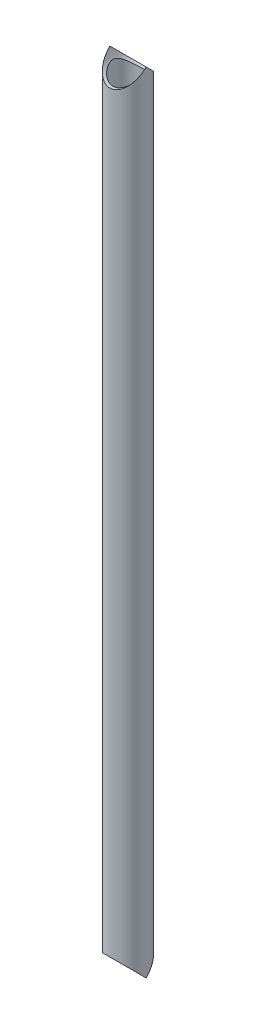
ISO-10303-21;
HEADER;
FILE_DESCRIPTION(('STEP AP214'),'2;1');
FILE_NAME('part.step','',(''),(''),'','','');
FILE_SCHEMA(('AUTOMOTIVE_DESIGN { 1 0 10303 214 1 1 1 1 }'));
ENDSEC;
DATA;
#1=APPLICATION_CONTEXT('core data for automotive mechanical design processes');
#2=APPLICATION_PROTOCOL_DEFINITION('international standard','automotive_design',2000,#1);
#3=PRODUCT_CONTEXT('',#1,'mechanical');
#4=PRODUCT('Part','Part','',(#3));
#5=PRODUCT_RELATED_PRODUCT_CATEGORY('part','',(#4));
#6=PRODUCT_DEFINITION_FORMATION('','',#4);
#7=PRODUCT_DEFINITION_CONTEXT('part definition',#1,'design');
#8=PRODUCT_DEFINITION('design','',#6,#7);
#9=PRODUCT_DEFINITION_SHAPE('','',#8);
#10=(LENGTH_UNIT() NAMED_UNIT(*) SI_UNIT(.MILLI.,.METRE.));
#11=(NAMED_UNIT(*) PLANE_ANGLE_UNIT() SI_UNIT($,.RADIAN.));
#12=(NAMED_UNIT(*) SI_UNIT($,.STERADIAN.) SOLID_ANGLE_UNIT());
#13=UNCERTAINTY_MEASURE_WITH_UNIT(LENGTH_MEASURE(1.E-05),#10,'distance_accuracy_value','');
#14=(GEOMETRIC_REPRESENTATION_CONTEXT(3) GLOBAL_UNCERTAINTY_ASSIGNED_CONTEXT((#13)) GLOBAL_UNIT_ASSIGNED_CONTEXT((#10,
#11,#12)) REPRESENTATION_CONTEXT('',''));
#15=CARTESIAN_POINT('',(0.,0.,0.));
#16=DIRECTION('',(0.,0.,1.));
#17=DIRECTION('',(1.,0.,0.));
#18=AXIS2_PLACEMENT_3D('',#15,#16,#17);
#19=CARTESIAN_POINT('',(0.,914.4,0.));
#20=DIRECTION('',(0.,-1.,0.));
#21=DIRECTION('',(0.,0.,-1.));
#22=AXIS2_PLACEMENT_3D('',#19,#20,#21);
#23=CYLINDRICAL_SURFACE('',#22,17.526);
#24=CARTESIAN_POINT('',(0.,21.0819999999998,-17.526));
#25=CARTESIAN_POINT('',(-0.416555730228914,21.0819968997673,-17.525996813955));
#26=CARTESIAN_POINT('',(-0.833163012071561,21.0696266860189,-17.5111221446535));
#27=CARTESIAN_POINT('',(-1.66285085098592,21.020429275249,-17.4518957288154));
#28=CARTESIAN_POINT('',(-2.07593080746842,20.9835979942068,-17.4075390599622));
#29=CARTESIAN_POINT('',(-2.89546158233794,20.8862975609339,-17.2901260170745));
#30=CARTESIAN_POINT('',(-3.30190733638106,20.825811156567,-17.2170486963236));
#31=CARTESIAN_POINT('',(-4.10484124386306,20.6825370575954,-17.0434647188049));
#32=CARTESIAN_POINT('',(-4.5013295874392,20.5997497891813,-16.9429585862272));
#33=CARTESIAN_POINT('',(-5.27944797465432,20.4141416620052,-16.7167963170662));
#34=CARTESIAN_POINT('',(-5.66115402240747,20.3114463445973,-16.5912976561353));
#35=CARTESIAN_POINT('',(-6.41026860382345,20.0876087406197,-16.3165047587702));
#36=CARTESIAN_POINT('',(-6.77767737045171,19.9664667547852,-16.1672109102661));
#37=CARTESIAN_POINT('',(-7.49674702968465,19.7077528854373,-15.8465909890382));
#38=CARTESIAN_POINT('',(-7.84840695050785,19.5701799899711,-15.6752635592522));
#39=CARTESIAN_POINT('',(-8.53495429518088,19.2806677526613,-15.3122852034019));
#40=CARTESIAN_POINT('',(-8.86983814178559,19.1287253665192,-15.1206299696701));
#41=CARTESIAN_POINT('',(-9.64160099861962,18.754609910401,-14.6449374869007));
#42=CARTESIAN_POINT('',(-10.0709113512938,18.5270972306164,-14.3527749107547));
#43=CARTESIAN_POINT('',(-10.8958978241819,18.0542615344176,-13.7370028939555));
#44=CARTESIAN_POINT('',(-11.2915625079795,17.8089325142131,-13.4133828401386));
#45=CARTESIAN_POINT('',(-12.0497757762481,17.3049511249642,-12.7366579401323));
#46=CARTESIAN_POINT('',(-12.4122381349312,17.04626664933,-12.3834806406871));
#47=CARTESIAN_POINT('',(-13.102805813699,16.5213580554328,-11.6503545982694));
#48=CARTESIAN_POINT('',(-13.4309154311957,16.2551348855413,-11.2704092138659));
#49=CARTESIAN_POINT('',(-14.0584742968282,15.7157331372709,-10.4776077506457));
#50=CARTESIAN_POINT('',(-14.3572918160694,15.4425162506562,-10.0642778803075));
#51=CARTESIAN_POINT('',(-14.9191165849368,14.9004369213683,-9.21095532717232));
#52=CARTESIAN_POINT('',(-15.1821118547605,14.6315759617741,-8.77095379548325));
#53=CARTESIAN_POINT('',(-15.6706637077535,14.1070589585618,-7.8648192590269));
#54=CARTESIAN_POINT('',(-15.8963093356672,13.8513725390918,-7.39875205622167));
#55=CARTESIAN_POINT('',(-16.3089147666568,13.3630801822784,-6.43838077354217));
#56=CARTESIAN_POINT('',(-16.4959076106971,13.1304546214542,-5.94410127510898));
#57=CARTESIAN_POINT('',(-16.7529770224336,12.7988575848124,-5.15602712210236));
#58=CARTESIAN_POINT('',(-16.837735543251,12.6869431617481,-4.872411200417));
#59=CARTESIAN_POINT('',(-16.9938564773723,12.4770445460745,-4.29634473218565));
#60=CARTESIAN_POINT('',(-17.0652171570416,12.37906215662,-4.00389304799844));
#61=CARTESIAN_POINT('',(-17.1934754104678,12.2002966527806,-3.41127303424144));
#62=CARTESIAN_POINT('',(-17.2504011700851,12.1194800710743,-3.11112102298284));
#63=CARTESIAN_POINT('',(-17.3489622258268,11.9779668612121,-2.50374822431797));
#64=CARTESIAN_POINT('',(-17.3906055672393,11.9172596483083,-2.19653124698381));
#65=CARTESIAN_POINT('',(-17.4581424184477,11.8181076616682,-1.57275012439621));
#66=CARTESIAN_POINT('',(-17.4838316609619,11.7799519110117,-1.25611705495763));
#67=CARTESIAN_POINT('',(-17.517930419636,11.7291856156857,-0.619877416859204));
#68=CARTESIAN_POINT('',(-17.526341492641,11.7165727694807,-0.300271118708453));
#69=CARTESIAN_POINT('',(-17.5256372212721,11.7176262618389,0.338900631657969));
#70=CARTESIAN_POINT('',(-17.5165207489109,11.7312942917112,0.658466079921142));
#71=CARTESIAN_POINT('',(-17.4810304342677,11.7841114494979,1.29450990358542));
#72=CARTESIAN_POINT('',(-17.454654452937,11.8232637357882,1.61098789140886));
#73=CARTESIAN_POINT('',(-17.3822895125155,11.9294257421046,2.2659718078756));
#74=CARTESIAN_POINT('',(-17.3347748801548,11.998589304393,2.6039563959663));
#75=CARTESIAN_POINT('',(-17.2213863424108,12.1607694942197,3.27094152568147));
#76=CARTESIAN_POINT('',(-17.1555094618906,12.2537899869736,3.59994060193885));
#77=CARTESIAN_POINT('',(-17.0065131076897,12.4597510354757,4.24855727345002));
#78=CARTESIAN_POINT('',(-16.9233482836622,12.5727438642604,4.56814761827546));
#79=CARTESIAN_POINT('',(-16.7410384013215,12.8144963392732,5.19667563423269));
#80=CARTESIAN_POINT('',(-16.6418871073676,12.9432621331347,5.50560909125266));
#81=CARTESIAN_POINT('',(-16.3663636741079,13.2916029845913,6.28987340285505));
#82=CARTESIAN_POINT('',(-16.1786783054546,13.5203443554787,6.75718011774375));
#83=CARTESIAN_POINT('',(-15.7683263145676,13.9967738082267,7.66612047395264));
#84=CARTESIAN_POINT('',(-15.5456394491178,14.2444728114884,8.10773905469757));
#85=CARTESIAN_POINT('',(-15.0664754392744,14.7503770479215,8.96683638051192));
#86=CARTESIAN_POINT('',(-14.8099532398125,15.0085959668399,9.38428185098056));
#87=CARTESIAN_POINT('',(-14.2641231324515,15.5282830342338,10.1948087082539));
#88=CARTESIAN_POINT('',(-13.9748217341554,15.7897505284258,10.5878949086503));
#89=CARTESIAN_POINT('',(-13.348195218157,16.3234251206626,11.368790869149));
#90=CARTESIAN_POINT('',(-13.0091843032674,16.5955090988731,11.7553355433848));
#91=CARTESIAN_POINT('',(-12.2951909614096,17.1312086263667,12.5002060187878));
#92=CARTESIAN_POINT('',(-11.9202031744408,17.3948229059611,12.8585276006225));
#93=CARTESIAN_POINT('',(-11.1350258886843,17.9075751721612,13.5441070863272));
#94=CARTESIAN_POINT('',(-10.7249051788906,18.1567399150729,13.8714231651622));
#95=CARTESIAN_POINT('',(-10.0834868401277,18.5157794970999,14.3371461507588));
#96=CARTESIAN_POINT('',(-9.86533064247428,18.6329972737408,14.4881649831134));
#97=CARTESIAN_POINT('',(-9.42027707168281,18.8619121286756,14.7814103315513));
#98=CARTESIAN_POINT('',(-9.19337757252923,18.973607848963,14.9236346869964));
#99=CARTESIAN_POINT('',(-8.6149822408404,19.2452568870863,15.2678084182525));
#100=CARTESIAN_POINT('',(-8.25811349099292,19.4012909317911,15.4639027842677));
#101=CARTESIAN_POINT('',(-7.52616004996056,19.6967858085575,15.8330525436508));
#102=CARTESIAN_POINT('',(-7.15107971509293,19.8362505768411,16.0061134100713));
#103=CARTESIAN_POINT('',(-6.38410638575881,20.0962128240883,16.3271734823368));
#104=CARTESIAN_POINT('',(-5.99221937735619,20.2167169860504,16.4751815198914));
#105=CARTESIAN_POINT('',(-5.19343454244426,20.436499890184,16.7441479493524));
#106=CARTESIAN_POINT('',(-4.78653646212595,20.5357782732744,16.8651058836479));
#107=CARTESIAN_POINT('',(-3.95712937963003,20.7116605964591,17.0788335101842));
#108=CARTESIAN_POINT('',(-3.53452536865484,20.7880868143263,17.1713824047498));
#109=CARTESIAN_POINT('',(-2.67986601870683,20.9154410422601,17.325342710614));
#110=CARTESIAN_POINT('',(-2.24781066246177,20.9663690057248,17.3867540650041));
#111=CARTESIAN_POINT('',(-1.37821649825802,21.0414257838521,17.4771905064637));
#112=CARTESIAN_POINT('',(-0.940680508218279,21.0655678414146,17.5062315973617));
#113=CARTESIAN_POINT('',(-0.0640313485042574,21.0864599875857,17.5313661812511));
#114=CARTESIAN_POINT('',(0.375081652379896,21.0832129252077,17.5274631010918));
#115=CARTESIAN_POINT('',(1.19930498558244,21.0514143660162,17.4891990815668));
#116=CARTESIAN_POINT('',(1.58470875998577,21.0258753246363,17.4584640327402));
#117=CARTESIAN_POINT('',(2.3506999758323,20.9540657673614,17.3719144045829));
#118=CARTESIAN_POINT('',(2.7312878660405,20.9077971979815,17.3161021800126));
#119=CARTESIAN_POINT('',(3.4851379152623,20.7954274560101,17.1802563891461));
#120=CARTESIAN_POINT('',(3.85839963308748,20.7293250928908,17.1002213688688));
#121=CARTESIAN_POINT('',(4.59536738648551,20.5785036951395,16.9170761014037));
#122=CARTESIAN_POINT('',(4.95907294143575,20.4937837261429,16.813964696073));
#123=CARTESIAN_POINT('',(5.68108005964258,20.3056044955685,16.5840874699882));
#124=CARTESIAN_POINT('',(6.03918783157448,20.201854007984,16.4569529541794));
#125=CARTESIAN_POINT('',(6.74203119401677,19.978282082118,16.1817226350541));
#126=CARTESIAN_POINT('',(7.08676703852218,19.8584609492855,16.033627230131));
#127=CARTESIAN_POINT('',(7.76177112537953,19.6044812930531,15.7179651464271));
#128=CARTESIAN_POINT('',(8.09203732526572,19.4703207547056,15.5503957309038));
#129=CARTESIAN_POINT('',(8.73727082208686,19.1894423499118,15.1972398091077));
#130=CARTESIAN_POINT('',(9.05223503545286,19.0427219687953,15.0116496938152));
#131=CARTESIAN_POINT('',(9.80464712063617,18.6699370794282,14.5364034891831));
#132=CARTESIAN_POINT('',(10.2333578451482,18.4379030040814,14.2375288779349));
#133=CARTESIAN_POINT('',(11.0565036944503,17.9563917650947,13.6081978996813));
#134=CARTESIAN_POINT('',(11.4509254939543,17.7069078875162,13.2777293585403));
#135=CARTESIAN_POINT('',(12.2062013475732,17.1950010449314,12.5869774042746));
#136=CARTESIAN_POINT('',(12.5669530526875,16.9325421153533,12.2266089972621));
#137=CARTESIAN_POINT('',(13.2534705598351,16.4007538587034,11.4788424530418));
#138=CARTESIAN_POINT('',(13.5792413783914,16.1314255236301,11.091448204724));
#139=CARTESIAN_POINT('',(14.2012900820747,15.5867872016978,10.2834169092843));
#140=CARTESIAN_POINT('',(14.4969406813881,15.3114559960582,9.86231131131106));
#141=CARTESIAN_POINT('',(15.0517275612926,14.7664279251479,8.99289776114395));
#142=CARTESIAN_POINT('',(15.3108500388739,14.4967332223755,8.5445796171063));
#143=CARTESIAN_POINT('',(15.7906628138659,13.9725273173833,7.62139093429983));
#144=CARTESIAN_POINT('',(16.0114631279653,13.7179740773539,7.14660175430656));
#145=CARTESIAN_POINT('',(16.4132437140876,13.2346006167626,6.16809279152973));
#146=CARTESIAN_POINT('',(16.5942626782093,13.0057554988661,5.66440172614308));
#147=CARTESIAN_POINT('',(16.8388425611419,12.6855836344331,4.86810478458095));
#148=CARTESIAN_POINT('',(16.9179225696371,12.5797308138898,4.58604260557911));
#149=CARTESIAN_POINT('',(17.0628066541921,12.3824994036349,4.01353560636158));
#150=CARTESIAN_POINT('',(17.1286126119829,12.2911187627404,3.72309198098287));
#151=CARTESIAN_POINT('',(17.2459247048065,12.1259670617047,3.13503376582405));
#152=CARTESIAN_POINT('',(17.2974603903694,12.0521596564627,2.83743540296241));
#153=CARTESIAN_POINT('',(17.3854671554674,11.9248591935397,2.23575303013731));
#154=CARTESIAN_POINT('',(17.4219421463683,11.8713608617439,1.93167072569967));
#155=CARTESIAN_POINT('',(17.4793343349965,11.7866990130922,1.31542257105257));
#156=CARTESIAN_POINT('',(17.5000736934338,11.7557909436761,1.00320440672012));
#157=CARTESIAN_POINT('',(17.524756770186,11.7189645820465,0.376634351053807));
#158=CARTESIAN_POINT('',(17.5287017145648,11.7130444656063,0.0622826171578451));
#159=CARTESIAN_POINT('',(17.519682115217,11.7265307633987,-0.565765427557155));
#160=CARTESIAN_POINT('',(17.5067100959756,11.7459483742384,-0.879461387224774));
#161=CARTESIAN_POINT('',(17.4642111799082,11.809041781387,-1.50326166249687));
#162=CARTESIAN_POINT('',(17.4346819572413,11.852720985788,-1.81336546725253));
#163=CARTESIAN_POINT('',(17.3549094765865,11.96927086672,-2.46783373112707));
#164=CARTESIAN_POINT('',(17.302463431889,12.0452105753978,-2.81137909094886));
#165=CARTESIAN_POINT('',(17.1787080018257,12.2210563923495,-3.48874159064598));
#166=CARTESIAN_POINT('',(17.1073947213456,12.3209674490773,-3.82255670590959));
#167=CARTESIAN_POINT('',(16.947078987979,12.5405634031639,-4.48018532937921));
#168=CARTESIAN_POINT('',(16.8580308311813,12.6602992529502,-4.80397044519041));
#169=CARTESIAN_POINT('',(16.6635408359202,12.9152189041231,-5.44039078400244));
#170=CARTESIAN_POINT('',(16.5580926547885,13.0504086768926,-5.75302163536554));
#171=CARTESIAN_POINT('',(16.2655608949425,13.4150718576144,-6.54686642927646));
#172=CARTESIAN_POINT('',(16.0668060807317,13.6534382167155,-7.01971862379038));
#173=CARTESIAN_POINT('',(15.6331071713109,14.1479717487759,-7.93883090279256));
#174=CARTESIAN_POINT('',(15.3981425218364,14.4041489863427,-8.38507568297605));
#175=CARTESIAN_POINT('',(14.8931005076266,14.9257588221093,-9.25247800104908));
#176=CARTESIAN_POINT('',(14.6229771058186,15.1912032153183,-9.67360157184705));
#177=CARTESIAN_POINT('',(14.0485414814653,15.72395355153,-10.4903942108925));
#178=CARTESIAN_POINT('',(13.7442360709218,15.9912591137027,-10.8860683262348));
#179=CARTESIAN_POINT('',(13.0872302237908,16.5337413720381,-11.6686564771626));
#180=CARTESIAN_POINT('',(12.7329783860626,16.8087386854629,-12.0543962817462));
#181=CARTESIAN_POINT('',(11.9872775461264,17.348425170836,-12.7961902436963));
#182=CARTESIAN_POINT('',(11.5958224834141,17.6131126533502,-13.152239546604));
#183=CARTESIAN_POINT('',(10.7766237873918,18.1258932833979,-13.8313916713884));
#184=CARTESIAN_POINT('',(10.3489546907979,18.3740187224037,-14.1545592898453));
#185=CARTESIAN_POINT('',(9.68055384180458,18.7296913286835,-14.6123392874481));
#186=CARTESIAN_POINT('',(9.45330032462155,18.8454830325594,-14.7604208100896));
#187=CARTESIAN_POINT('',(8.98986303225809,19.0709068455624,-15.0471693205304));
#188=CARTESIAN_POINT('',(8.75367713542611,19.1805374757202,-15.1858340494739));
#189=CARTESIAN_POINT('',(8.16388969440316,19.4408675438858,-15.5135810654739));
#190=CARTESIAN_POINT('',(7.80547285234006,19.5877303847882,-15.6971201066553));
#191=CARTESIAN_POINT('',(7.07152507053701,19.8644917176114,-16.0411475968502));
#192=CARTESIAN_POINT('',(6.69599823719459,19.994394251376,-16.2016415386993));
#193=CARTESIAN_POINT('',(5.9296918679262,20.2348842112989,-16.4975121757087));
#194=CARTESIAN_POINT('',(5.53893068115662,20.3454940458589,-16.6329180221442));
#195=CARTESIAN_POINT('',(4.74382214338555,20.5454327030717,-16.8768969338329));
#196=CARTESIAN_POINT('',(4.33947723349787,20.6347653263282,-16.9854747913175));
#197=CARTESIAN_POINT('',(3.61139042732517,20.7729058197692,-17.1529959877095));
#198=CARTESIAN_POINT('',(3.28980936544944,20.8263084699169,-17.2176086822696));
#199=CARTESIAN_POINT('',(2.64139463379421,20.9184362904734,-17.3289327236609));
#200=CARTESIAN_POINT('',(2.31455996491092,20.9571586337942,-17.3756406224611));
#201=CARTESIAN_POINT('',(1.65730095597494,21.019349282237,-17.4505998410856));
#202=CARTESIAN_POINT('',(1.32687627951209,21.0428161450527,-17.4788494157967));
#203=CARTESIAN_POINT('',(0.66431170552805,21.0741408485292,-17.5165484873698));
#204=CARTESIAN_POINT('',(0.332172243283634,21.0820024722048,-17.5260025406341));
#205=CARTESIAN_POINT('',(0.,21.0819999999998,-17.526));
#206=B_SPLINE_CURVE_WITH_KNOTS('',3,(#24,#25,#26,#27,#28,#29,#30,#31,#32,#33,#34,#35,#36,#37,
#38,#39,#40,#41,#42,#43,#44,#45,#46,#47,#48,#49,#50,#51,#52,#53,#54,#55,#56,#57,#58,#59,#60,#61,
#62,#63,#64,#65,#66,#67,#68,#69,#70,#71,#72,#73,#74,#75,#76,#77,#78,#79,#80,#81,#82,#83,#84,#85,
#86,#87,#88,#89,#90,#91,#92,#93,#94,#95,#96,#97,#98,#99,#100,#101,#102,#103,#104,#105,#106,#107,
#108,#109,#110,#111,#112,#113,#114,#115,#116,#117,#118,#119,#120,#121,#122,#123,#124,#125,#126,
#127,#128,#129,#130,#131,#132,#133,#134,#135,#136,#137,#138,#139,#140,#141,#142,#143,#144,#145,
#146,#147,#148,#149,#150,#151,#152,#153,#154,#155,#156,#157,#158,#159,#160,#161,#162,#163,#164,
#165,#166,#167,#168,#169,#170,#171,#172,#173,#174,#175,#176,#177,#178,#179,#180,#181,#182,#183,
#184,#185,#186,#187,#188,#189,#190,#191,#192,#193,#194,#195,#196,#197,#198,#199,#200,#201,#202,
#203,#204,#205),.UNSPECIFIED.,.T.,.F.,(4,2,2,2,2,2,2,2,2,2,2,2,2,2,2,2,2,2,2,2,2,2,2,2,2,2,2,2,
2,2,2,2,2,2,2,2,2,2,2,2,2,2,2,2,2,2,2,2,2,2,2,2,2,2,2,2,2,2,2,2,2,2,2,2,2,2,2,2,2,2,2,2,2,2,2,2,
2,2,2,2,2,2,2,2,2,2,2,2,2,2,4),(0.,1.24931215514069,2.49883294793603,3.74926674484587,
4.99967664647633,6.24244384055411,7.48519077601582,8.72801428973387,9.97110169852849,
11.6694991969452,13.3684717049052,15.0717382323204,16.7747914316099,18.508900041403,
20.2435871614538,21.974077138334,23.7030816933734,24.6518793950268,25.6007997833557,
26.5478527733324,27.4944064783684,28.4528421356183,29.4111914294722,30.3696024000782,
31.3281321733839,32.3712679495731,33.4145728378166,34.4606499010714,35.5071359859367,
37.1638893836605,38.8216045193316,40.4815497807695,42.1411659704712,43.8844508919194,
45.6279959405213,47.3682019789461,48.238133531576,49.1082779678088,50.4151915777868,
51.7217940919451,53.0279350344375,54.3340980714494,55.6501696985348,56.9662437309291,
58.2816668085292,59.5969530576399,60.7579780281908,61.9188940006416,63.0798796712698,
64.240923621771,65.4214962902465,66.6020465231705,67.7827628635307,68.9637161565106,
70.6766447530631,72.3902360758569,74.1088773225334,75.8272717729952,77.5762157648222,
79.3258188748362,81.0703129492534,82.8131027115062,83.7469352207905,84.6806352566832,
85.6123870984828,86.5438968054863,87.4857834704328,88.4276013724583,89.3698355997799,
90.3122022187916,91.377728536685,92.4434750028669,93.5120043575647,94.5809479956883,
96.2751844313667,97.9703861554527,99.6678303471318,101.364936859805,103.137598327809,
104.910549063674,106.679935458133,107.564410898222,108.449097758104,109.733689326203,
111.01797419982,112.300757301214,113.58331109564,114.579500372221,115.575881394522,
116.57235660447,117.568590219854),.UNSPECIFIED.);
#207=CARTESIAN_POINT('',(0.,21.0819999999998,-17.526));
#208=VERTEX_POINT('',#207);
#209=EDGE_CURVE('E38',#208,#208,#206,.T.);
#210=ORIENTED_EDGE('',*,*,#209,.F.);
#211=EDGE_LOOP('',(#210));
#212=FACE_BOUND('',#211,.T.);
#213=CARTESIAN_POINT('',(0.,893.318,-17.526));
#214=CARTESIAN_POINT('',(0.416555730228908,893.318003100232,-17.525996813955));
#215=CARTESIAN_POINT('',(0.833163012071547,893.330373313981,-17.5111221446535));
#216=CARTESIAN_POINT('',(1.6628508509859,893.379570724751,-17.4518957288154));
#217=CARTESIAN_POINT('',(2.0759308074684,893.416402005793,-17.4075390599622));
#218=CARTESIAN_POINT('',(2.89546158233793,893.513702439066,-17.2901260170745));
#219=CARTESIAN_POINT('',(3.30190733638107,893.574188843433,-17.2170486963236));
#220=CARTESIAN_POINT('',(4.10484124386307,893.717462942405,-17.0434647188049));
#221=CARTESIAN_POINT('',(4.5013295874392,893.800250210819,-16.9429585862272));
#222=CARTESIAN_POINT('',(5.2794479746543,893.985858337995,-16.7167963170662));
#223=CARTESIAN_POINT('',(5.66115402240745,894.088553655403,-16.5912976561353));
#224=CARTESIAN_POINT('',(6.41026860382345,894.31239125938,-16.3165047587702));
#225=CARTESIAN_POINT('',(6.77767737045173,894.433533245215,-16.1672109102661));
#226=CARTESIAN_POINT('',(7.49674702968468,894.692247114563,-15.8465909890381));
#227=CARTESIAN_POINT('',(7.84840695050788,894.829820010029,-15.6752635592522));
#228=CARTESIAN_POINT('',(8.53495429518089,895.119332247339,-15.3122852034019));
#229=CARTESIAN_POINT('',(8.86983814178559,895.271274633481,-15.1206299696701));
#230=CARTESIAN_POINT('',(9.64160099861961,895.645390089599,-14.6449374869007));
#231=CARTESIAN_POINT('',(10.0709113512938,895.872902769384,-14.3527749107548));
#232=CARTESIAN_POINT('',(10.8958978241818,896.345738465582,-13.7370028939555));
#233=CARTESIAN_POINT('',(11.2915625079794,896.591067485787,-13.4133828401387));
#234=CARTESIAN_POINT('',(12.049775776248,897.095048875036,-12.7366579401323));
#235=CARTESIAN_POINT('',(12.4122381349312,897.35373335067,-12.3834806406871));
#236=CARTESIAN_POINT('',(13.102805813699,897.878641944567,-11.6503545982694));
#237=CARTESIAN_POINT('',(13.4309154311957,898.144865114459,-11.2704092138659));
#238=CARTESIAN_POINT('',(14.0584742968281,898.684266862729,-10.4776077506457));
#239=CARTESIAN_POINT('',(14.3572918160693,898.957483749344,-10.0642778803076));
#240=CARTESIAN_POINT('',(14.9191165849367,899.499563078632,-9.2109553271724));
#241=CARTESIAN_POINT('',(15.1821118547605,899.768424038226,-8.77095379548331));
#242=CARTESIAN_POINT('',(15.6706637077535,900.292941041438,-7.86481925902695));
#243=CARTESIAN_POINT('',(15.8963093356671,900.548627460908,-7.39875205622174));
#244=CARTESIAN_POINT('',(16.3089147666568,901.036919817721,-6.43838077354225));
#245=CARTESIAN_POINT('',(16.4959076106971,901.269545378546,-5.94410127510905));
#246=CARTESIAN_POINT('',(16.7529770224336,901.601142415187,-5.15602712210242));
#247=CARTESIAN_POINT('',(16.837735543251,901.713056838252,-4.87241120041706));
#248=CARTESIAN_POINT('',(16.9938564773723,901.922955453925,-4.29634473218571));
#249=CARTESIAN_POINT('',(17.0652171570416,902.02093784338,-4.0038930479985));
#250=CARTESIAN_POINT('',(17.1934754104677,902.199703347219,-3.4112730342415));
#251=CARTESIAN_POINT('',(17.250401170085,902.280519928926,-3.11112102298291));
#252=CARTESIAN_POINT('',(17.3489622258268,902.422033138788,-2.50374822431804));
#253=CARTESIAN_POINT('',(17.3906055672393,902.482740351692,-2.19653124698387));
#254=CARTESIAN_POINT('',(17.4581424184477,902.581892338332,-1.57275012439625));
#255=CARTESIAN_POINT('',(17.4838316609619,902.620048088988,-1.25611705495767));
#256=CARTESIAN_POINT('',(17.517930419636,902.670814384314,-0.619877416859243));
#257=CARTESIAN_POINT('',(17.526341492641,902.683427230519,-0.300271118708489));
#258=CARTESIAN_POINT('',(17.5256372212721,902.682373738161,0.338900631657942));
#259=CARTESIAN_POINT('',(17.5165207489109,902.668705708289,0.658466079921121));
#260=CARTESIAN_POINT('',(17.4810304342677,902.615888550502,1.29450990358541));
#261=CARTESIAN_POINT('',(17.454654452937,902.576736264212,1.61098789140885));
#262=CARTESIAN_POINT('',(17.3822895125155,902.470574257895,2.26597180787559));
#263=CARTESIAN_POINT('',(17.3347748801548,902.401410695607,2.60395639596629));
#264=CARTESIAN_POINT('',(17.2213863424108,902.23923050578,3.27094152568144));
#265=CARTESIAN_POINT('',(17.1555094618906,902.146210013026,3.59994060193882));
#266=CARTESIAN_POINT('',(17.0065131076898,901.940248964524,4.24855727344998));
#267=CARTESIAN_POINT('',(16.9233482836622,901.82725613574,4.56814761827543));
#268=CARTESIAN_POINT('',(16.7410384013215,901.585503660727,5.19667563423265));
#269=CARTESIAN_POINT('',(16.6418871073676,901.456737866865,5.50560909125262));
#270=CARTESIAN_POINT('',(16.3663636741079,901.108397015409,6.289873402855));
#271=CARTESIAN_POINT('',(16.1786783054546,900.879655644521,6.75718011774372));
#272=CARTESIAN_POINT('',(15.7683263145676,900.403226191773,7.66612047395261));
#273=CARTESIAN_POINT('',(15.5456394491178,900.155527188512,8.10773905469755));
#274=CARTESIAN_POINT('',(15.0664754392744,899.649622952079,8.96683638051188));
#275=CARTESIAN_POINT('',(14.8099532398125,899.39140403316,9.38428185098051));
#276=CARTESIAN_POINT('',(14.2641231324516,898.871716965766,10.1948087082538));
#277=CARTESIAN_POINT('',(13.9748217341555,898.610249471574,10.5878949086502));
#278=CARTESIAN_POINT('',(13.348195218157,898.076574879337,11.368790869149));
#279=CARTESIAN_POINT('',(13.0091843032674,897.804490901127,11.7553355433847));
#280=CARTESIAN_POINT('',(12.2951909614096,897.268791373633,12.5002060187878));
#281=CARTESIAN_POINT('',(11.9202031744409,897.005177094039,12.8585276006224));
#282=CARTESIAN_POINT('',(11.1350258886844,896.492424827839,13.5441070863271));
#283=CARTESIAN_POINT('',(10.7249051788906,896.243260084927,13.8714231651621));
#284=CARTESIAN_POINT('',(10.0834868401277,895.8842205029,14.3371461507587));
#285=CARTESIAN_POINT('',(9.86533064247433,895.767002726259,14.4881649831134));
#286=CARTESIAN_POINT('',(9.42027707168287,895.538087871324,14.7814103315513));
#287=CARTESIAN_POINT('',(9.1933775725293,895.426392151037,14.9236346869964));
#288=CARTESIAN_POINT('',(8.61498224084048,895.154743112914,15.2678084182525));
#289=CARTESIAN_POINT('',(8.258113490993,894.998709068209,15.4639027842676));
#290=CARTESIAN_POINT('',(7.52616004996062,894.703214191442,15.8330525436508));
#291=CARTESIAN_POINT('',(7.151079715093,894.563749423159,16.0061134100713));
#292=CARTESIAN_POINT('',(6.38410638575886,894.303787175912,16.3271734823368));
#293=CARTESIAN_POINT('',(5.99221937735624,894.18328301395,16.4751815198914));
#294=CARTESIAN_POINT('',(5.1934345424443,893.963500109816,16.7441479493523));
#295=CARTESIAN_POINT('',(4.78653646212598,893.864221726726,16.8651058836479));
#296=CARTESIAN_POINT('',(3.95712937963006,893.688339403541,17.0788335101842));
#297=CARTESIAN_POINT('',(3.53452536865488,893.611913185674,17.1713824047497));
#298=CARTESIAN_POINT('',(2.67986601870687,893.48455895774,17.325342710614));
#299=CARTESIAN_POINT('',(2.2478106624618,893.433630994275,17.3867540650041));
#300=CARTESIAN_POINT('',(1.37821649825805,893.358574216148,17.4771905064637));
#301=CARTESIAN_POINT('',(0.940680508218306,893.334432158585,17.5062315973617));
#302=CARTESIAN_POINT('',(0.0640313485042822,893.313540012414,17.5313661812511));
#303=CARTESIAN_POINT('',(-0.375081652379873,893.316787074792,17.5274631010918));
#304=CARTESIAN_POINT('',(-1.19930498558242,893.348585633984,17.4891990815668));
#305=CARTESIAN_POINT('',(-1.58470875998574,893.374124675364,17.4584640327402));
#306=CARTESIAN_POINT('',(-2.35069997583228,893.445934232638,17.3719144045829));
#307=CARTESIAN_POINT('',(-2.73128786604048,893.492202802018,17.3161021800126));
#308=CARTESIAN_POINT('',(-3.48513791526229,893.60457254399,17.1802563891461));
#309=CARTESIAN_POINT('',(-3.85839963308747,893.670674907109,17.1002213688688));
#310=CARTESIAN_POINT('',(-4.59536738648551,893.82149630486,16.9170761014037));
#311=CARTESIAN_POINT('',(-4.95907294143576,893.906216273857,16.813964696073));
#312=CARTESIAN_POINT('',(-5.68108005964257,894.094395504432,16.5840874699882));
#313=CARTESIAN_POINT('',(-6.03918783157445,894.198145992016,16.4569529541794));
#314=CARTESIAN_POINT('',(-6.74203119401673,894.421717917882,16.1817226350541));
#315=CARTESIAN_POINT('',(-7.08676703852217,894.541539050715,16.033627230131));
#316=CARTESIAN_POINT('',(-7.76177112537953,894.795518706947,15.7179651464271));
#317=CARTESIAN_POINT('',(-8.0920373252657,894.929679245294,15.5503957309038));
#318=CARTESIAN_POINT('',(-8.73727082208684,895.210557650088,15.1972398091077));
#319=CARTESIAN_POINT('',(-9.05223503545284,895.357278031205,15.0116496938153));
#320=CARTESIAN_POINT('',(-9.80464712063615,895.730062920572,14.5364034891832));
#321=CARTESIAN_POINT('',(-10.2333578451482,895.962096995919,14.2375288779349));
#322=CARTESIAN_POINT('',(-11.0565036944503,896.443608234905,13.6081978996813));
#323=CARTESIAN_POINT('',(-11.4509254939542,896.693092112484,13.2777293585403));
#324=CARTESIAN_POINT('',(-12.2062013475731,897.204998955068,12.5869774042746));
#325=CARTESIAN_POINT('',(-12.5669530526875,897.467457884647,12.2266089972621));
#326=CARTESIAN_POINT('',(-13.253470559835,897.999246141297,11.4788424530419));
#327=CARTESIAN_POINT('',(-13.5792413783913,898.26857447637,11.091448204724));
#328=CARTESIAN_POINT('',(-14.2012900820747,898.813212798302,10.2834169092844));
#329=CARTESIAN_POINT('',(-14.4969406813881,899.088544003942,9.86231131131113));
#330=CARTESIAN_POINT('',(-15.0517275612925,899.633572074852,8.99289776114401));
#331=CARTESIAN_POINT('',(-15.3108500388738,899.903266777624,8.54457961710635));
#332=CARTESIAN_POINT('',(-15.7906628138659,900.427472682617,7.62139093429989));
#333=CARTESIAN_POINT('',(-16.0114631279653,900.682025922646,7.14660175430664));
#334=CARTESIAN_POINT('',(-16.4132437140876,901.165399383237,6.16809279152981));
#335=CARTESIAN_POINT('',(-16.5942626782093,901.394244501134,5.66440172614313));
#336=CARTESIAN_POINT('',(-16.8388425611419,901.714416365567,4.868104784581));
#337=CARTESIAN_POINT('',(-16.9179225696371,901.82026918611,4.58604260557917));
#338=CARTESIAN_POINT('',(-17.062806654192,902.017500596365,4.01353560636164));
#339=CARTESIAN_POINT('',(-17.1286126119829,902.10888123726,3.72309198098293));
#340=CARTESIAN_POINT('',(-17.2459247048064,902.274032938295,3.1350337658241));
#341=CARTESIAN_POINT('',(-17.2974603903694,902.347840343537,2.83743540296246));
#342=CARTESIAN_POINT('',(-17.3854671554674,902.47514080646,2.23575303013736));
#343=CARTESIAN_POINT('',(-17.4219421463683,902.528639138256,1.93167072569972));
#344=CARTESIAN_POINT('',(-17.4793343349965,902.613300986908,1.31542257105262));
#345=CARTESIAN_POINT('',(-17.5000736934338,902.644209056324,1.00320440672017));
#346=CARTESIAN_POINT('',(-17.524756770186,902.681035417954,0.376634351053856));
#347=CARTESIAN_POINT('',(-17.5287017145648,902.686955534394,0.0622826171578929));
#348=CARTESIAN_POINT('',(-17.519682115217,902.673469236601,-0.565765427557103));
#349=CARTESIAN_POINT('',(-17.5067100959756,902.654051625762,-0.879461387224717));
#350=CARTESIAN_POINT('',(-17.4642111799082,902.590958218613,-1.50326166249681));
#351=CARTESIAN_POINT('',(-17.4346819572414,902.547279014212,-1.81336546725247));
#352=CARTESIAN_POINT('',(-17.3549094765865,902.43072913328,-2.46783373112701));
#353=CARTESIAN_POINT('',(-17.302463431889,902.354789424602,-2.8113790909488));
#354=CARTESIAN_POINT('',(-17.1787080018257,902.17894360765,-3.48874159064591));
#355=CARTESIAN_POINT('',(-17.1073947213456,902.079032550923,-3.82255670590952));
#356=CARTESIAN_POINT('',(-16.947078987979,901.859436596836,-4.48018532937912));
#357=CARTESIAN_POINT('',(-16.8580308311813,901.73970074705,-4.80397044519031));
#358=CARTESIAN_POINT('',(-16.6635408359203,901.484781095877,-5.44039078400233));
#359=CARTESIAN_POINT('',(-16.5580926547885,901.349591323107,-5.75302163536543));
#360=CARTESIAN_POINT('',(-16.2655608949425,900.984928142386,-6.54686642927635));
#361=CARTESIAN_POINT('',(-16.0668060807317,900.746561783285,-7.01971862379027));
#362=CARTESIAN_POINT('',(-15.6331071713109,900.252028251224,-7.93883090279246));
#363=CARTESIAN_POINT('',(-15.3981425218364,899.995851013657,-8.38507568297597));
#364=CARTESIAN_POINT('',(-14.8931005076266,899.474241177891,-9.25247800104903));
#365=CARTESIAN_POINT('',(-14.6229771058186,899.208796784682,-9.67360157184701));
#366=CARTESIAN_POINT('',(-14.0485414814653,898.67604644847,-10.4903942108924));
#367=CARTESIAN_POINT('',(-13.7442360709218,898.408740886297,-10.8860683262347));
#368=CARTESIAN_POINT('',(-13.0872302237908,897.866258627962,-11.6686564771625));
#369=CARTESIAN_POINT('',(-12.7329783860627,897.591261314537,-12.0543962817462));
#370=CARTESIAN_POINT('',(-11.9872775461264,897.051574829164,-12.7961902436963));
#371=CARTESIAN_POINT('',(-11.5958224834141,896.78688734665,-13.152239546604));
#372=CARTESIAN_POINT('',(-10.7766237873919,896.274106716602,-13.8313916713884));
#373=CARTESIAN_POINT('',(-10.348954690798,896.025981277596,-14.1545592898453));
#374=CARTESIAN_POINT('',(-9.68055384180468,895.670308671317,-14.612339287448));
#375=CARTESIAN_POINT('',(-9.45330032462166,895.554516967441,-14.7604208100895));
#376=CARTESIAN_POINT('',(-8.98986303225821,895.329093154438,-15.0471693205303));
#377=CARTESIAN_POINT('',(-8.75367713542623,895.21946252428,-15.1858340494738));
#378=CARTESIAN_POINT('',(-8.16388969440329,894.959132456114,-15.5135810654738));
#379=CARTESIAN_POINT('',(-7.8054728523402,894.812269615212,-15.6971201066552));
#380=CARTESIAN_POINT('',(-7.07152507053716,894.535508282389,-16.0411475968502));
#381=CARTESIAN_POINT('',(-6.69599823719473,894.405605748624,-16.2016415386992));
#382=CARTESIAN_POINT('',(-5.92969186792632,894.165115788701,-16.4975121757087));
#383=CARTESIAN_POINT('',(-5.53893068115673,894.054505954141,-16.6329180221441));
#384=CARTESIAN_POINT('',(-4.74382214338566,893.854567296928,-16.8768969338329));
#385=CARTESIAN_POINT('',(-4.33947723349796,893.765234673672,-16.9854747913174));
#386=CARTESIAN_POINT('',(-3.61139042732527,893.627094180231,-17.1529959877094));
#387=CARTESIAN_POINT('',(-3.28980936544954,893.573691530083,-17.2176086822695));
#388=CARTESIAN_POINT('',(-2.64139463379428,893.481563709527,-17.3289327236609));
#389=CARTESIAN_POINT('',(-2.31455996491098,893.442841366206,-17.3756406224611));
#390=CARTESIAN_POINT('',(-1.65730095597498,893.380650717763,-17.4505998410856));
#391=CARTESIAN_POINT('',(-1.32687627951212,893.357183854947,-17.4788494157967));
#392=CARTESIAN_POINT('',(-0.664311705528061,893.325859151471,-17.5165484873698));
#393=CARTESIAN_POINT('',(-0.33217224328364,893.317997527795,-17.5260025406341));
#394=CARTESIAN_POINT('',(0.,893.318,-17.526));
#395=B_SPLINE_CURVE_WITH_KNOTS('',3,(#213,#214,#215,#216,#217,#218,#219,#220,#221,#222,#223,
#224,#225,#226,#227,#228,#229,#230,#231,#232,#233,#234,#235,#236,#237,#238,#239,#240,#241,#242,
#243,#244,#245,#246,#247,#248,#249,#250,#251,#252,#253,#254,#255,#256,#257,#258,#259,#260,#261,
#262,#263,#264,#265,#266,#267,#268,#269,#270,#271,#272,#273,#274,#275,#276,#277,#278,#279,#280,
#281,#282,#283,#284,#285,#286,#287,#288,#289,#290,#291,#292,#293,#294,#295,#296,#297,#298,#299,
#300,#301,#302,#303,#304,#305,#306,#307,#308,#309,#310,#311,#312,#313,#314,#315,#316,#317,#318,
#319,#320,#321,#322,#323,#324,#325,#326,#327,#328,#329,#330,#331,#332,#333,#334,#335,#336,#337,
#338,#339,#340,#341,#342,#343,#344,#345,#346,#347,#348,#349,#350,#351,#352,#353,#354,#355,#356,
#357,#358,#359,#360,#361,#362,#363,#364,#365,#366,#367,#368,#369,#370,#371,#372,#373,#374,#375,
#376,#377,#378,#379,#380,#381,#382,#383,#384,#385,#386,#387,#388,#389,#390,#391,#392,#393,#394),
.UNSPECIFIED.,.T.,.F.,(4,2,2,2,2,2,2,2,2,2,2,2,2,2,2,2,2,2,2,2,2,2,2,2,2,2,2,2,2,2,2,2,2,2,2,2,
2,2,2,2,2,2,2,2,2,2,2,2,2,2,2,2,2,2,2,2,2,2,2,2,2,2,2,2,2,2,2,2,2,2,2,2,2,2,2,2,2,2,2,2,2,2,2,2,
2,2,2,2,2,2,4),(0.,1.24931215514068,2.49883294793602,3.7492667448459,4.99967664647634,
6.24244384055409,7.48519077601583,8.72801428973391,9.97110169852847,11.6694991969451,
13.3684717049052,15.0717382323203,16.7747914316098,18.5089000414029,20.2435871614537,
21.9740771383338,23.7030816933733,24.6518793950267,25.6007997833556,26.5478527733323,
27.4944064783683,28.4528421356183,29.4111914294722,30.3696024000782,31.3281321733839,
32.371267949573,33.4145728378165,34.4606499010713,35.5071359859366,37.1638893836604,
38.8216045193315,40.4815497807693,42.1411659704711,43.8844508919193,45.6279959405212,
47.368201978946,48.2381335315759,49.1082779678087,50.4151915777867,51.721794091945,
53.0279350344374,54.3340980714493,55.6501696985347,56.966243730929,58.2816668085292,
59.5969530576398,60.7579780281907,61.9188940006416,63.0798796712698,64.2409236217709,
65.4214962902464,66.6020465231705,67.7827628635306,68.9637161565105,70.676644753063,
72.3902360758568,74.1088773225333,75.8272717729951,77.5762157648221,79.3258188748361,
81.0703129492533,82.8131027115061,83.7469352207904,84.6806352566831,85.6123870984827,
86.5438968054862,87.4857834704327,88.4276013724582,89.3698355997798,90.3122022187915,
91.3777285366849,92.4434750028668,93.5120043575646,94.5809479956881,96.2751844313666,
97.9703861554526,99.6678303471318,101.364936859805,103.137598327809,104.910549063673,
106.679935458133,107.564410898222,108.449097758104,109.733689326203,111.01797419982,
112.300757301213,113.58331109564,114.579500372221,115.575881394522,116.57235660447,
117.568590219854),.UNSPECIFIED.);
#396=CARTESIAN_POINT('',(0.,893.318,-17.526));
#397=VERTEX_POINT('',#396);
#398=EDGE_CURVE('E67',#397,#397,#395,.T.);
#399=ORIENTED_EDGE('',*,*,#398,.F.);
#400=EDGE_LOOP('',(#399));
#401=FACE_BOUND('',#400,.T.);
#402=ADVANCED_FACE('F34',(#212,#401),#23,.F.);
#403=CARTESIAN_POINT('',(0.,914.4,-21.082));
#404=DIRECTION('',(0.,0.,1.));
#405=DIRECTION('',(1.,0.,0.));
#406=AXIS2_PLACEMENT_3D('',#403,#404,#405);
#407=CYLINDRICAL_SURFACE('',#406,21.082);
#408=ORIENTED_EDGE('',*,*,#398,.T.);
#409=EDGE_LOOP('',(#408));
#410=FACE_BOUND('',#409,.T.);
#411=CARTESIAN_POINT('',(0.,914.4,0.));
#412=DIRECTION('',(0.,-0.707106781186548,-0.707106781186547));
#413=DIRECTION('',(0.,-0.707106781186548,0.707106781186547));
#414=AXIS2_PLACEMENT_3D('',#411,#412,#413);
#415=ELLIPSE('',#414,29.8144503219496,21.082);
#416=CARTESIAN_POINT('',(21.082,914.4,0.));
#417=VERTEX_POINT('',#416);
#418=CARTESIAN_POINT('',(-21.082,914.4,0.));
#419=VERTEX_POINT('',#418);
#420=EDGE_CURVE('E64',#417,#419,#415,.T.);
#421=ORIENTED_EDGE('',*,*,#420,.F.);
#422=CARTESIAN_POINT('',(0.,914.4,0.));
#423=DIRECTION('',(0.,-0.707106781186548,0.707106781186547));
#424=DIRECTION('',(0.,-0.707106781186548,-0.707106781186547));
#425=AXIS2_PLACEMENT_3D('',#422,#423,#424);
#426=ELLIPSE('',#425,29.8144503219496,21.082);
#427=EDGE_CURVE('E58',#419,#417,#426,.T.);
#428=ORIENTED_EDGE('',*,*,#427,.F.);
#429=EDGE_LOOP('',(#421,#428));
#430=FACE_BOUND('',#429,.T.);
#431=ADVANCED_FACE('F66',(#410,#430),#407,.F.);
#432=CARTESIAN_POINT('',(0.,0.,-21.082));
#433=DIRECTION('',(0.,0.,1.));
#434=DIRECTION('',(1.,0.,0.));
#435=AXIS2_PLACEMENT_3D('',#432,#433,#434);
#436=CYLINDRICAL_SURFACE('',#435,21.082);
#437=ORIENTED_EDGE('',*,*,#209,.T.);
#438=EDGE_LOOP('',(#437));
#439=FACE_BOUND('',#438,.T.);
#440=CARTESIAN_POINT('',(0.,-1.11022302462516E-13,0.));
#441=DIRECTION('',(0.,-0.707106781186548,-0.707106781186547));
#442=DIRECTION('',(0.,-0.707106781186548,0.707106781186547));
#443=AXIS2_PLACEMENT_3D('',#440,#441,#442);
#444=ELLIPSE('',#443,29.8144503219496,21.082);
#445=CARTESIAN_POINT('',(21.082,-1.11022302462516E-13,0.));
#446=VERTEX_POINT('',#445);
#447=CARTESIAN_POINT('',(-21.082,0.,-1.11022302462516E-13));
#448=VERTEX_POINT('',#447);
#449=EDGE_CURVE('E46',#446,#448,#444,.F.);
#450=ORIENTED_EDGE('',*,*,#449,.F.);
#451=CARTESIAN_POINT('',(0.,-1.11022302462516E-13,0.));
#452=DIRECTION('',(0.,-0.707106781186548,0.707106781186547));
#453=DIRECTION('',(0.,-0.707106781186548,-0.707106781186547));
#454=AXIS2_PLACEMENT_3D('',#451,#452,#453);
#455=ELLIPSE('',#454,29.8144503219496,21.082);
#456=EDGE_CURVE('E11',#448,#446,#455,.F.);
#457=ORIENTED_EDGE('',*,*,#456,.F.);
#458=EDGE_LOOP('',(#450,#457));
#459=FACE_BOUND('',#458,.T.);
#460=ADVANCED_FACE('F77',(#439,#459),#436,.F.);
#461=CARTESIAN_POINT('',(0.,914.4,0.));
#462=DIRECTION('',(0.,-1.,0.));
#463=DIRECTION('',(0.,0.,-1.));
#464=AXIS2_PLACEMENT_3D('',#461,#462,#463);
#465=CYLINDRICAL_SURFACE('',#464,21.082);
#466=ORIENTED_EDGE('',*,*,#449,.T.);
#467=ORIENTED_EDGE('',*,*,#456,.T.);
#468=EDGE_LOOP('',(#466,#467));
#469=FACE_BOUND('',#468,.T.);
#470=ORIENTED_EDGE('',*,*,#427,.T.);
#471=ORIENTED_EDGE('',*,*,#420,.T.);
#472=EDGE_LOOP('',(#470,#471));
#473=FACE_BOUND('',#472,.T.);
#474=ADVANCED_FACE('F36',(#469,#473),#465,.T.);
#475=CLOSED_SHELL('',(#402,#431,#460,#474));
#476=MANIFOLD_SOLID_BREP('B2',#475);
#477=ADVANCED_BREP_SHAPE_REPRESENTATION('',(#18,#476),#14);
#478=SHAPE_DEFINITION_REPRESENTATION(#9,#477);
ENDSEC;
END-ISO-10303-21;
